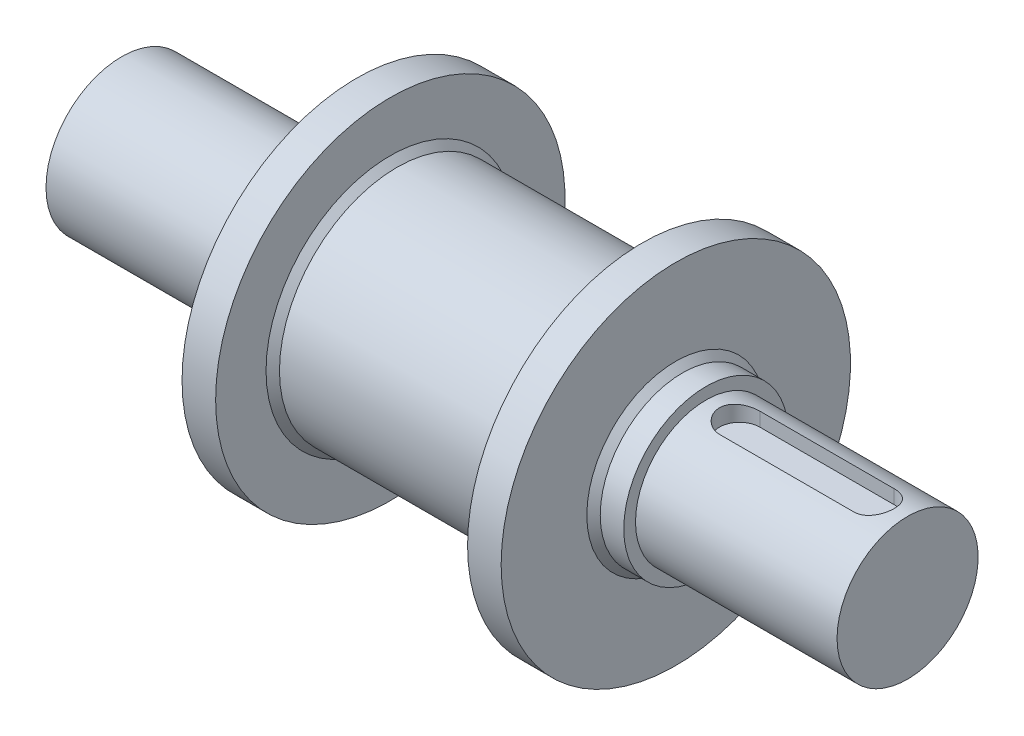
ISO-10303-21;
HEADER;
FILE_DESCRIPTION(('STEP AP214'),'2;1');
FILE_NAME('part.step','',(''),(''),'','','');
FILE_SCHEMA(('AUTOMOTIVE_DESIGN { 1 0 10303 214 1 1 1 1 }'));
ENDSEC;
DATA;
#1=APPLICATION_CONTEXT('core data for automotive mechanical design processes');
#2=APPLICATION_PROTOCOL_DEFINITION('international standard','automotive_design',2000,#1);
#3=PRODUCT_CONTEXT('',#1,'mechanical');
#4=PRODUCT('Part','Part','',(#3));
#5=PRODUCT_RELATED_PRODUCT_CATEGORY('part','',(#4));
#6=PRODUCT_DEFINITION_FORMATION('','',#4);
#7=PRODUCT_DEFINITION_CONTEXT('part definition',#1,'design');
#8=PRODUCT_DEFINITION('design','',#6,#7);
#9=PRODUCT_DEFINITION_SHAPE('','',#8);
#10=(LENGTH_UNIT() NAMED_UNIT(*) SI_UNIT(.MILLI.,.METRE.));
#11=(NAMED_UNIT(*) PLANE_ANGLE_UNIT() SI_UNIT($,.RADIAN.));
#12=(NAMED_UNIT(*) SI_UNIT($,.STERADIAN.) SOLID_ANGLE_UNIT());
#13=UNCERTAINTY_MEASURE_WITH_UNIT(LENGTH_MEASURE(1.E-05),#10,'distance_accuracy_value','');
#14=(GEOMETRIC_REPRESENTATION_CONTEXT(3) GLOBAL_UNCERTAINTY_ASSIGNED_CONTEXT((#13)) GLOBAL_UNIT_ASSIGNED_CONTEXT((#10,
#11,#12)) REPRESENTATION_CONTEXT('',''));
#15=CARTESIAN_POINT('',(0.,0.,0.));
#16=DIRECTION('',(0.,0.,1.));
#17=DIRECTION('',(1.,0.,0.));
#18=AXIS2_PLACEMENT_3D('',#15,#16,#17);
#19=CARTESIAN_POINT('',(0.,0.,0.));
#20=DIRECTION('',(-1.,0.,0.));
#21=DIRECTION('',(0.,0.,1.));
#22=AXIS2_PLACEMENT_3D('',#19,#20,#21);
#23=CYLINDRICAL_SURFACE('',#22,21.);
#24=CARTESIAN_POINT('',(174.,0.,0.));
#25=DIRECTION('',(-1.,0.,0.));
#26=DIRECTION('',(0.,0.,1.));
#27=AXIS2_PLACEMENT_3D('',#24,#25,#26);
#28=CIRCLE('',#27,21.);
#29=CARTESIAN_POINT('',(174.,0.,21.));
#30=VERTEX_POINT('',#29);
#31=EDGE_CURVE('E116',#30,#30,#28,.T.);
#32=ORIENTED_EDGE('',*,*,#31,.F.);
#33=EDGE_LOOP('',(#32));
#34=FACE_BOUND('',#33,.T.);
#35=CARTESIAN_POINT('',(234.,0.,0.));
#36=DIRECTION('',(-1.,0.,0.));
#37=DIRECTION('',(0.,0.,1.));
#38=AXIS2_PLACEMENT_3D('',#35,#36,#37);
#39=CIRCLE('',#38,21.);
#40=CARTESIAN_POINT('',(234.,0.,21.));
#41=VERTEX_POINT('',#40);
#42=EDGE_CURVE('E112',#41,#41,#39,.T.);
#43=ORIENTED_EDGE('',*,*,#42,.T.);
#44=EDGE_LOOP('',(#43));
#45=FACE_BOUND('',#44,.T.);
#46=CARTESIAN_POINT('',(224.,20.1246117974981,6.));
#47=CARTESIAN_POINT('',(224.165052331312,20.1245894844569,6.00002192169975));
#48=CARTESIAN_POINT('',(224.330096651925,20.1266415650335,5.9931904240759));
#49=CARTESIAN_POINT('',(224.658933521624,20.1347317436705,5.96598259693693));
#50=CARTESIAN_POINT('',(224.822726323157,20.1407690151806,5.94560907610498));
#51=CARTESIAN_POINT('',(225.147509956324,20.1566481622527,5.89154299099));
#52=CARTESIAN_POINT('',(225.308506490729,20.1664810208216,5.85788198887896));
#53=CARTESIAN_POINT('',(225.626960229472,20.1896457121068,5.77753958210296));
#54=CARTESIAN_POINT('',(225.78441735477,20.2029776228772,5.73085788698049));
#55=CARTESIAN_POINT('',(226.094635546118,20.2327374247249,5.62488729317033));
#56=CARTESIAN_POINT('',(226.247398940812,20.2491637507907,5.56560476546173));
#57=CARTESIAN_POINT('',(226.547368364294,20.2846467474582,5.43485915630498));
#58=CARTESIAN_POINT('',(226.694572302487,20.3037043952519,5.36339154736578));
#59=CARTESIAN_POINT('',(226.98243459612,20.3439081708857,5.20881695763319));
#60=CARTESIAN_POINT('',(227.123092954147,20.3650542979004,5.12570998143986));
#61=CARTESIAN_POINT('',(227.39705541808,20.4088630364894,4.94839867436058));
#62=CARTESIAN_POINT('',(227.530356713522,20.4315262203764,4.85419014508329));
#63=CARTESIAN_POINT('',(227.792038174735,20.4783436926205,4.65278362553809));
#64=CARTESIAN_POINT('',(227.92020679912,20.5025212494045,4.54531610125279));
#65=CARTESIAN_POINT('',(228.167146297308,20.5511665277305,4.32005021369056));
#66=CARTESIAN_POINT('',(228.285913661986,20.5756343537369,4.20224802715341));
#67=CARTESIAN_POINT('',(228.513215821272,20.6241797197623,3.95712206741071));
#68=CARTESIAN_POINT('',(228.621752630168,20.6482573358332,3.82980017742367));
#69=CARTESIAN_POINT('',(228.827939004997,20.6953839164428,3.56636964243007));
#70=CARTESIAN_POINT('',(228.925584545105,20.7184324987362,3.43025777747806));
#71=CARTESIAN_POINT('',(229.110945589449,20.7632735217347,3.14758929991082));
#72=CARTESIAN_POINT('',(229.198446889581,20.7850352899036,3.00088721837233));
#73=CARTESIAN_POINT('',(229.360771883345,20.826226420028,2.70024415256809));
#74=CARTESIAN_POINT('',(229.435591029334,20.8456549445903,2.54630059678401));
#75=CARTESIAN_POINT('',(229.571883383942,20.8816082415408,2.23235057760216));
#76=CARTESIAN_POINT('',(229.633361393562,20.898134058101,2.07234631966332));
#77=CARTESIAN_POINT('',(229.742475461033,20.9278108104084,1.74738349510969));
#78=CARTESIAN_POINT('',(229.790112095636,20.9409618867737,1.58242513524158));
#79=CARTESIAN_POINT('',(229.870065575121,20.9632114411614,1.25311298298007));
#80=CARTESIAN_POINT('',(229.902747347622,20.9724060858907,1.08885424992111));
#81=CARTESIAN_POINT('',(229.954270098755,20.9869654862023,0.758072191863195));
#82=CARTESIAN_POINT('',(229.973116248908,20.9923316727767,0.591549736734752));
#83=CARTESIAN_POINT('',(229.996814450333,20.9990869856429,0.257425560637054));
#84=CARTESIAN_POINT('',(230.001666015127,21.0004759736798,0.0898238023521121));
#85=CARTESIAN_POINT('',(229.997328274917,20.999236691677,-0.245181542828501));
#86=CARTESIAN_POINT('',(229.988139201944,20.9966084880238,-0.412585132953262));
#87=CARTESIAN_POINT('',(229.9562782772,20.9875445764644,-0.741067651658925));
#88=CARTESIAN_POINT('',(229.934007021276,20.9812220240654,-0.902188755140108));
#89=CARTESIAN_POINT('',(229.876494480959,20.9650286514685,-1.22197090652229));
#90=CARTESIAN_POINT('',(229.841249023442,20.9551566896347,-1.38063114576114));
#91=CARTESIAN_POINT('',(229.758089652863,20.9321284663263,-1.69432288207988));
#92=CARTESIAN_POINT('',(229.710177676022,20.918972706835,-1.84935492983109));
#93=CARTESIAN_POINT('',(229.602064962077,20.8897205698511,-2.15478873602949));
#94=CARTESIAN_POINT('',(229.541863855878,20.8736241040379,-2.30519035524902));
#95=CARTESIAN_POINT('',(229.408898376357,20.8387145142278,-2.60202980978099));
#96=CARTESIAN_POINT('',(229.336002252832,20.8198732783987,-2.74840530116376));
#97=CARTESIAN_POINT('',(229.178676237705,20.7801082571492,-3.0344604453685));
#98=CARTESIAN_POINT('',(229.09424991134,20.7591851160121,-3.17414215000025));
#99=CARTESIAN_POINT('',(228.914385979091,20.7157807359019,-3.44606990247428));
#100=CARTESIAN_POINT('',(228.818942919324,20.6932987274225,-3.57831221881556));
#101=CARTESIAN_POINT('',(228.617740718797,20.6473712971919,-3.83444718075924));
#102=CARTESIAN_POINT('',(228.511984957411,20.6239261924859,-3.95834253922788));
#103=CARTESIAN_POINT('',(228.28687436197,20.5758300072593,-4.20132091996746));
#104=CARTESIAN_POINT('',(228.16717064798,20.551165615785,-4.32007832115666));
#105=CARTESIAN_POINT('',(227.918208426458,20.5021333353903,-4.54708837545202));
#106=CARTESIAN_POINT('',(227.788953240124,20.4777653468064,-4.65534464996528));
#107=CARTESIAN_POINT('',(227.52158790413,20.4299846752419,-4.86074636422665));
#108=CARTESIAN_POINT('',(227.383471887605,20.4065726423519,-4.95788432140759));
#109=CARTESIAN_POINT('',(227.099406524312,20.3614014610979,-5.14024855061122));
#110=CARTESIAN_POINT('',(226.953460255218,20.3396416713267,-5.22547945590107));
#111=CARTESIAN_POINT('',(226.65330100046,20.2982196174412,-5.38414968403492));
#112=CARTESIAN_POINT('',(226.499025684695,20.2785778839985,-5.45747656574094));
#113=CARTESIAN_POINT('',(226.184550166332,20.242230137917,-5.59078652189583));
#114=CARTESIAN_POINT('',(226.024352400501,20.2255229337991,-5.65077501464742));
#115=CARTESIAN_POINT('',(225.699294796548,20.1955798271004,-5.75687380467081));
#116=CARTESIAN_POINT('',(225.534440027613,20.1823402998656,-5.80299860073585));
#117=CARTESIAN_POINT('',(225.201205342495,20.1597438752569,-5.88101802101864));
#118=CARTESIAN_POINT('',(225.032827097457,20.1503851792111,-5.91291923804017));
#119=CARTESIAN_POINT('',(224.720401863552,20.136996182678,-5.95834488604588));
#120=CARTESIAN_POINT('',(224.576682044629,20.1323602730056,-5.97396720737166));
#121=CARTESIAN_POINT('',(224.288645245918,20.1261641867038,-5.99479248698429));
#122=CARTESIAN_POINT('',(224.144329514862,20.1245993190641,-6.00001133674436));
#123=CARTESIAN_POINT('',(224.,20.1246117974981,-6.));
#124=B_SPLINE_CURVE_WITH_KNOTS('',3,(#46,#47,#48,#49,#50,#51,#52,#53,#54,#55,#56,#57,#58,#59,
#60,#61,#62,#63,#64,#65,#66,#67,#68,#69,#70,#71,#72,#73,#74,#75,#76,#77,#78,#79,#80,#81,#82,#83,
#84,#85,#86,#87,#88,#89,#90,#91,#92,#93,#94,#95,#96,#97,#98,#99,#100,#101,#102,#103,#104,#105,
#106,#107,#108,#109,#110,#111,#112,#113,#114,#115,#116,#117,#118,#119,#120,#121,#122,#123),
.UNSPECIFIED.,.F.,.F.,(4,2,2,2,2,2,2,2,2,2,2,2,2,2,2,2,2,2,2,2,2,2,2,2,2,2,2,2,2,2,2,2,2,2,2,2,
2,2,4),(0.,0.494990614565442,0.98987859762957,1.48359806377502,1.97732854438847,2.4708099862205,
2.96447518729517,3.45814019326608,3.95199249653474,4.45841161341089,4.96501887414657,
5.47152618001261,5.97822009394079,6.49417839820206,7.01032132824592,7.52627820764116,
8.04221358474347,8.54478221320034,9.04716289419293,9.54956103869483,10.0519508808723,
10.5397044924402,11.027615126156,11.5154512202231,12.0033019682409,12.4965554906444,
12.9896568387743,13.4830033544228,13.9761887449054,14.4868330315598,14.997300587207,
15.5081096895234,16.0187194690592,16.5339022452487,17.0488753606756,17.5633080229981,
18.077501990939,18.5110248049339,18.9438848967365),.UNSPECIFIED.);
#125=CARTESIAN_POINT('',(224.,20.1246117974981,6.));
#126=VERTEX_POINT('',#125);
#127=CARTESIAN_POINT('',(224.,20.1246117974981,-6.));
#128=VERTEX_POINT('',#127);
#129=EDGE_CURVE('E11',#126,#128,#124,.T.);
#130=ORIENTED_EDGE('',*,*,#129,.F.);
#131=DIRECTION('',(-1.,0.,0.));
#132=VECTOR('',#131,1.);
#133=CARTESIAN_POINT('',(0.,20.1246117974981,6.00000000000002));
#134=LINE('',#133,#132);
#135=CARTESIAN_POINT('',(184.,20.1246117974981,6.));
#136=VERTEX_POINT('',#135);
#137=EDGE_CURVE('E51',#126,#136,#134,.T.);
#138=ORIENTED_EDGE('',*,*,#137,.T.);
#139=CARTESIAN_POINT('',(184.,20.1246117974981,6.));
#140=CARTESIAN_POINT('',(183.834947668688,20.1245894844569,6.00002192169975));
#141=CARTESIAN_POINT('',(183.669903348075,20.1266415650335,5.9931904240759));
#142=CARTESIAN_POINT('',(183.341066478376,20.1347317436705,5.96598259693693));
#143=CARTESIAN_POINT('',(183.177273676843,20.1407690151806,5.94560907610498));
#144=CARTESIAN_POINT('',(182.852490043676,20.1566481622527,5.89154299099));
#145=CARTESIAN_POINT('',(182.691493509271,20.1664810208216,5.85788198887896));
#146=CARTESIAN_POINT('',(182.373039770528,20.1896457121068,5.77753958210296));
#147=CARTESIAN_POINT('',(182.21558264523,20.2029776228772,5.73085788698049));
#148=CARTESIAN_POINT('',(181.905364453882,20.2327374247249,5.62488729317033));
#149=CARTESIAN_POINT('',(181.752601059188,20.2491637507907,5.56560476546173));
#150=CARTESIAN_POINT('',(181.452631635706,20.2846467474582,5.43485915630498));
#151=CARTESIAN_POINT('',(181.305427697513,20.3037043952519,5.36339154736578));
#152=CARTESIAN_POINT('',(181.01756540388,20.3439081708857,5.20881695763319));
#153=CARTESIAN_POINT('',(180.876907045853,20.3650542979004,5.12570998143987));
#154=CARTESIAN_POINT('',(180.60294458192,20.4088630364894,4.94839867436059));
#155=CARTESIAN_POINT('',(180.469643286478,20.4315262203764,4.85419014508329));
#156=CARTESIAN_POINT('',(180.207961825265,20.4783436926205,4.65278362553809));
#157=CARTESIAN_POINT('',(180.07979320088,20.5025212494045,4.54531610125279));
#158=CARTESIAN_POINT('',(179.832853702692,20.5511665277305,4.32005021369056));
#159=CARTESIAN_POINT('',(179.714086338014,20.5756343537369,4.20224802715341));
#160=CARTESIAN_POINT('',(179.486784178728,20.6241797197623,3.95712206741071));
#161=CARTESIAN_POINT('',(179.378247369831,20.6482573358332,3.82980017742366));
#162=CARTESIAN_POINT('',(179.172060995003,20.6953839164428,3.56636964243007));
#163=CARTESIAN_POINT('',(179.074415454895,20.7184324987362,3.43025777747806));
#164=CARTESIAN_POINT('',(178.889054410551,20.7632735217347,3.14758929991082));
#165=CARTESIAN_POINT('',(178.801553110419,20.7850352899036,3.00088721837233));
#166=CARTESIAN_POINT('',(178.639228116655,20.826226420028,2.70024415256809));
#167=CARTESIAN_POINT('',(178.564408970666,20.8456549445903,2.54630059678401));
#168=CARTESIAN_POINT('',(178.428116616058,20.8816082415408,2.23235057760216));
#169=CARTESIAN_POINT('',(178.366638606438,20.898134058101,2.07234631966332));
#170=CARTESIAN_POINT('',(178.257524538966,20.9278108104084,1.74738349510969));
#171=CARTESIAN_POINT('',(178.209887904364,20.9409618867737,1.58242513524158));
#172=CARTESIAN_POINT('',(178.129934424879,20.9632114411614,1.25311298298007));
#173=CARTESIAN_POINT('',(178.097252652378,20.9724060858907,1.08885424992111));
#174=CARTESIAN_POINT('',(178.045729901245,20.9869654862023,0.758072191863195));
#175=CARTESIAN_POINT('',(178.026883751092,20.9923316727767,0.591549736734752));
#176=CARTESIAN_POINT('',(178.003185549667,20.9990869856429,0.257425560637054));
#177=CARTESIAN_POINT('',(177.998333984873,21.0004759736798,0.0898238023521121));
#178=CARTESIAN_POINT('',(178.002671725083,20.999236691677,-0.245181542828501));
#179=CARTESIAN_POINT('',(178.011860798056,20.9966084880238,-0.412585132953262));
#180=CARTESIAN_POINT('',(178.0437217228,20.9875445764644,-0.741067651658926));
#181=CARTESIAN_POINT('',(178.065992978724,20.9812220240654,-0.90218875514011));
#182=CARTESIAN_POINT('',(178.123505519041,20.9650286514685,-1.2219709065223));
#183=CARTESIAN_POINT('',(178.158750976558,20.9551566896347,-1.38063114576115));
#184=CARTESIAN_POINT('',(178.241910347137,20.9321284663263,-1.69432288207988));
#185=CARTESIAN_POINT('',(178.289822323978,20.918972706835,-1.84935492983109));
#186=CARTESIAN_POINT('',(178.397935037923,20.8897205698511,-2.15478873602949));
#187=CARTESIAN_POINT('',(178.458136144122,20.8736241040379,-2.30519035524902));
#188=CARTESIAN_POINT('',(178.591101623643,20.8387145142278,-2.60202980978099));
#189=CARTESIAN_POINT('',(178.663997747168,20.8198732783987,-2.74840530116376));
#190=CARTESIAN_POINT('',(178.821323762295,20.7801082571492,-3.0344604453685));
#191=CARTESIAN_POINT('',(178.90575008866,20.7591851160121,-3.17414215000025));
#192=CARTESIAN_POINT('',(179.085614020909,20.7157807359019,-3.44606990247428));
#193=CARTESIAN_POINT('',(179.181057080676,20.6932987274225,-3.57831221881556));
#194=CARTESIAN_POINT('',(179.382259281203,20.6473712971919,-3.83444718075924));
#195=CARTESIAN_POINT('',(179.488015042589,20.6239261924859,-3.95834253922788));
#196=CARTESIAN_POINT('',(179.71312563803,20.5758300072593,-4.20132091996746));
#197=CARTESIAN_POINT('',(179.83282935202,20.551165615785,-4.32007832115666));
#198=CARTESIAN_POINT('',(180.081791573542,20.5021333353903,-4.54708837545202));
#199=CARTESIAN_POINT('',(180.211046759876,20.4777653468064,-4.65534464996528));
#200=CARTESIAN_POINT('',(180.47841209587,20.4299846752419,-4.86074636422665));
#201=CARTESIAN_POINT('',(180.616528112395,20.4065726423519,-4.9578843214076));
#202=CARTESIAN_POINT('',(180.900593475688,20.3614014610979,-5.14024855061123));
#203=CARTESIAN_POINT('',(181.046539744782,20.3396416713267,-5.22547945590107));
#204=CARTESIAN_POINT('',(181.34669899954,20.2982196174412,-5.38414968403492));
#205=CARTESIAN_POINT('',(181.500974315305,20.2785778839985,-5.45747656574094));
#206=CARTESIAN_POINT('',(181.815449833668,20.242230137917,-5.59078652189583));
#207=CARTESIAN_POINT('',(181.975647599499,20.2255229337991,-5.65077501464742));
#208=CARTESIAN_POINT('',(182.300705203452,20.1955798271004,-5.75687380467081));
#209=CARTESIAN_POINT('',(182.465559972387,20.1823402998656,-5.80299860073585));
#210=CARTESIAN_POINT('',(182.798794657505,20.1597438752569,-5.88101802101864));
#211=CARTESIAN_POINT('',(182.967172902543,20.1503851792111,-5.91291923804017));
#212=CARTESIAN_POINT('',(183.279598136448,20.136996182678,-5.95834488604588));
#213=CARTESIAN_POINT('',(183.423317955371,20.1323602730056,-5.97396720737166));
#214=CARTESIAN_POINT('',(183.711354754082,20.1261641867038,-5.99479248698429));
#215=CARTESIAN_POINT('',(183.855670485138,20.1245993190641,-6.00001133674436));
#216=CARTESIAN_POINT('',(184.,20.1246117974981,-6.));
#217=B_SPLINE_CURVE_WITH_KNOTS('',3,(#139,#140,#141,#142,#143,#144,#145,#146,#147,#148,#149,
#150,#151,#152,#153,#154,#155,#156,#157,#158,#159,#160,#161,#162,#163,#164,#165,#166,#167,#168,
#169,#170,#171,#172,#173,#174,#175,#176,#177,#178,#179,#180,#181,#182,#183,#184,#185,#186,#187,
#188,#189,#190,#191,#192,#193,#194,#195,#196,#197,#198,#199,#200,#201,#202,#203,#204,#205,#206,
#207,#208,#209,#210,#211,#212,#213,#214,#215,#216),.UNSPECIFIED.,.F.,.F.,(4,2,2,2,2,2,2,2,2,2,2,
2,2,2,2,2,2,2,2,2,2,2,2,2,2,2,2,2,2,2,2,2,2,2,2,2,2,2,4),(0.,0.494990614565442,0.98987859762957,
1.48359806377502,1.97732854438847,2.4708099862205,2.96447518729517,3.45814019326605,
3.95199249653474,4.45841161341089,4.96501887414657,5.47152618001263,5.97822009394079,
6.49417839820206,7.01032132824592,7.52627820764117,8.04221358474347,8.54478221320035,
9.04716289419293,9.54956103869483,10.0519508808723,10.5397044924402,11.027615126156,
11.5154512202231,12.0033019682409,12.4965554906444,12.9896568387743,13.4830033544228,
13.9761887449054,14.4868330315598,14.997300587207,15.5081096895234,16.0187194690592,
16.5339022452487,17.0488753606756,17.5633080229981,18.077501990939,18.5110248049339,
18.9438848967365),.UNSPECIFIED.);
#218=CARTESIAN_POINT('',(184.,20.1246117974981,-6.));
#219=VERTEX_POINT('',#218);
#220=EDGE_CURVE('E63',#136,#219,#217,.T.);
#221=ORIENTED_EDGE('',*,*,#220,.T.);
#222=DIRECTION('',(-1.,0.,0.));
#223=VECTOR('',#222,1.);
#224=CARTESIAN_POINT('',(0.,20.1246117974981,-5.99999999999998));
#225=LINE('',#224,#223);
#226=EDGE_CURVE('E170',#219,#128,#225,.F.);
#227=ORIENTED_EDGE('',*,*,#226,.T.);
#228=EDGE_LOOP('',(#130,#138,#221,#227));
#229=FACE_BOUND('',#228,.T.);
#230=ADVANCED_FACE('F36',(#34,#45,#229),#23,.T.);
#231=CARTESIAN_POINT('',(0.,0.,0.));
#232=DIRECTION('',(1.,0.,0.));
#233=DIRECTION('',(0.,0.,-1.));
#234=AXIS2_PLACEMENT_3D('',#231,#232,#233);
#235=PLANE('',#234);
#236=CARTESIAN_POINT('',(0.,0.,0.));
#237=DIRECTION('',(-1.,0.,0.));
#238=DIRECTION('',(0.,0.,1.));
#239=AXIS2_PLACEMENT_3D('',#236,#237,#238);
#240=CIRCLE('',#239,22.5);
#241=CARTESIAN_POINT('',(0.,0.,22.5));
#242=VERTEX_POINT('',#241);
#243=EDGE_CURVE('E143',#242,#242,#240,.T.);
#244=ORIENTED_EDGE('',*,*,#243,.T.);
#245=EDGE_LOOP('',(#244));
#246=FACE_BOUND('',#245,.T.);
#247=ADVANCED_FACE('F199',(#246),#235,.F.);
#248=CARTESIAN_POINT('',(0.,0.,0.));
#249=DIRECTION('',(-1.,0.,0.));
#250=DIRECTION('',(0.,0.,1.));
#251=AXIS2_PLACEMENT_3D('',#248,#249,#250);
#252=CYLINDRICAL_SURFACE('',#251,22.5);
#253=ORIENTED_EDGE('',*,*,#243,.F.);
#254=EDGE_LOOP('',(#253));
#255=FACE_BOUND('',#254,.T.);
#256=CARTESIAN_POINT('',(65.,0.,0.));
#257=DIRECTION('',(-1.,0.,0.));
#258=DIRECTION('',(0.,0.,1.));
#259=AXIS2_PLACEMENT_3D('',#256,#257,#258);
#260=CIRCLE('',#259,22.5);
#261=CARTESIAN_POINT('',(65.,0.,22.5));
#262=VERTEX_POINT('',#261);
#263=EDGE_CURVE('E140',#262,#262,#260,.T.);
#264=ORIENTED_EDGE('',*,*,#263,.T.);
#265=EDGE_LOOP('',(#264));
#266=FACE_BOUND('',#265,.T.);
#267=ADVANCED_FACE('F204',(#255,#266),#252,.T.);
#268=CARTESIAN_POINT('',(65.,22.5,0.));
#269=DIRECTION('',(1.,0.,0.));
#270=DIRECTION('',(0.,0.,-1.));
#271=AXIS2_PLACEMENT_3D('',#268,#269,#270);
#272=PLANE('',#271);
#273=ORIENTED_EDGE('',*,*,#263,.F.);
#274=EDGE_LOOP('',(#273));
#275=FACE_BOUND('',#274,.T.);
#276=CARTESIAN_POINT('',(65.,0.,0.));
#277=DIRECTION('',(-1.,0.,0.));
#278=DIRECTION('',(0.,0.,1.));
#279=AXIS2_PLACEMENT_3D('',#276,#277,#278);
#280=CIRCLE('',#279,27.);
#281=CARTESIAN_POINT('',(65.,0.,27.));
#282=VERTEX_POINT('',#281);
#283=EDGE_CURVE('E137',#282,#282,#280,.T.);
#284=ORIENTED_EDGE('',*,*,#283,.T.);
#285=EDGE_LOOP('',(#284));
#286=FACE_BOUND('',#285,.T.);
#287=ADVANCED_FACE('F214',(#275,#286),#272,.F.);
#288=CARTESIAN_POINT('',(0.,0.,0.));
#289=DIRECTION('',(-1.,0.,0.));
#290=DIRECTION('',(0.,0.,1.));
#291=AXIS2_PLACEMENT_3D('',#288,#289,#290);
#292=CYLINDRICAL_SURFACE('',#291,27.);
#293=ORIENTED_EDGE('',*,*,#283,.F.);
#294=EDGE_LOOP('',(#293));
#295=FACE_BOUND('',#294,.T.);
#296=CARTESIAN_POINT('',(70.,0.,0.));
#297=DIRECTION('',(-1.,0.,0.));
#298=DIRECTION('',(0.,0.,1.));
#299=AXIS2_PLACEMENT_3D('',#296,#297,#298);
#300=CIRCLE('',#299,27.);
#301=CARTESIAN_POINT('',(70.,0.,27.));
#302=VERTEX_POINT('',#301);
#303=EDGE_CURVE('E134',#302,#302,#300,.T.);
#304=ORIENTED_EDGE('',*,*,#303,.T.);
#305=EDGE_LOOP('',(#304));
#306=FACE_BOUND('',#305,.T.);
#307=ADVANCED_FACE('F257',(#295,#306),#292,.T.);
#308=CARTESIAN_POINT('',(70.,27.,0.));
#309=DIRECTION('',(1.,0.,0.));
#310=DIRECTION('',(0.,0.,-1.));
#311=AXIS2_PLACEMENT_3D('',#308,#309,#310);
#312=PLANE('',#311);
#313=ORIENTED_EDGE('',*,*,#303,.F.);
#314=EDGE_LOOP('',(#313));
#315=FACE_BOUND('',#314,.T.);
#316=CARTESIAN_POINT('',(70.,0.,0.));
#317=DIRECTION('',(-1.,0.,0.));
#318=DIRECTION('',(0.,0.,1.));
#319=AXIS2_PLACEMENT_3D('',#316,#317,#318);
#320=CIRCLE('',#319,52.);
#321=CARTESIAN_POINT('',(70.,0.,52.));
#322=VERTEX_POINT('',#321);
#323=EDGE_CURVE('E131',#322,#322,#320,.T.);
#324=ORIENTED_EDGE('',*,*,#323,.T.);
#325=EDGE_LOOP('',(#324));
#326=FACE_BOUND('',#325,.T.);
#327=ADVANCED_FACE('F251',(#315,#326),#312,.F.);
#328=CARTESIAN_POINT('',(0.,0.,0.));
#329=DIRECTION('',(-1.,0.,0.));
#330=DIRECTION('',(0.,0.,1.));
#331=AXIS2_PLACEMENT_3D('',#328,#329,#330);
#332=CYLINDRICAL_SURFACE('',#331,52.);
#333=ORIENTED_EDGE('',*,*,#323,.F.);
#334=EDGE_LOOP('',(#333));
#335=FACE_BOUND('',#334,.T.);
#336=CARTESIAN_POINT('',(80.,0.,0.));
#337=DIRECTION('',(-1.,0.,0.));
#338=DIRECTION('',(0.,0.,1.));
#339=AXIS2_PLACEMENT_3D('',#336,#337,#338);
#340=CIRCLE('',#339,52.);
#341=CARTESIAN_POINT('',(80.,0.,52.));
#342=VERTEX_POINT('',#341);
#343=EDGE_CURVE('E128',#342,#342,#340,.T.);
#344=ORIENTED_EDGE('',*,*,#343,.T.);
#345=EDGE_LOOP('',(#344));
#346=FACE_BOUND('',#345,.T.);
#347=ADVANCED_FACE('F246',(#335,#346),#332,.T.);
#348=CARTESIAN_POINT('',(80.,52.,0.));
#349=DIRECTION('',(-1.,0.,0.));
#350=DIRECTION('',(0.,0.,1.));
#351=AXIS2_PLACEMENT_3D('',#348,#349,#350);
#352=PLANE('',#351);
#353=CARTESIAN_POINT('',(80.,0.,0.));
#354=DIRECTION('',(-1.,0.,0.));
#355=DIRECTION('',(0.,0.,1.));
#356=AXIS2_PLACEMENT_3D('',#353,#354,#355);
#357=CIRCLE('',#356,37.);
#358=CARTESIAN_POINT('',(80.,0.,37.));
#359=VERTEX_POINT('',#358);
#360=EDGE_CURVE('E161',#359,#359,#357,.T.);
#361=ORIENTED_EDGE('',*,*,#360,.T.);
#362=EDGE_LOOP('',(#361));
#363=FACE_BOUND('',#362,.T.);
#364=ORIENTED_EDGE('',*,*,#343,.F.);
#365=EDGE_LOOP('',(#364));
#366=FACE_BOUND('',#365,.T.);
#367=ADVANCED_FACE('F238',(#363,#366),#352,.F.);
#368=CARTESIAN_POINT('',(0.,0.,0.));
#369=DIRECTION('',(-1.,0.,0.));
#370=DIRECTION('',(0.,0.,1.));
#371=AXIS2_PLACEMENT_3D('',#368,#369,#370);
#372=CYLINDRICAL_SURFACE('',#371,35.);
#373=CARTESIAN_POINT('',(153.,0.,0.));
#374=DIRECTION('',(1.,0.,0.));
#375=DIRECTION('',(0.,0.,-1.));
#376=AXIS2_PLACEMENT_3D('',#373,#374,#375);
#377=CIRCLE('',#376,35.);
#378=CARTESIAN_POINT('',(153.,0.,-35.));
#379=VERTEX_POINT('',#378);
#380=EDGE_CURVE('E155',#379,#379,#377,.F.);
#381=ORIENTED_EDGE('',*,*,#380,.T.);
#382=EDGE_LOOP('',(#381));
#383=FACE_BOUND('',#382,.T.);
#384=CARTESIAN_POINT('',(82.,0.,0.));
#385=DIRECTION('',(-1.,0.,0.));
#386=DIRECTION('',(0.,0.,1.));
#387=AXIS2_PLACEMENT_3D('',#384,#385,#386);
#388=CIRCLE('',#387,35.);
#389=CARTESIAN_POINT('',(82.,0.,35.));
#390=VERTEX_POINT('',#389);
#391=EDGE_CURVE('E152',#390,#390,#388,.F.);
#392=ORIENTED_EDGE('',*,*,#391,.T.);
#393=EDGE_LOOP('',(#392));
#394=FACE_BOUND('',#393,.T.);
#395=ADVANCED_FACE('F234',(#383,#394),#372,.T.);
#396=CARTESIAN_POINT('',(155.,35.,0.));
#397=DIRECTION('',(1.,0.,0.));
#398=DIRECTION('',(0.,0.,-1.));
#399=AXIS2_PLACEMENT_3D('',#396,#397,#398);
#400=PLANE('',#399);
#401=CARTESIAN_POINT('',(155.,0.,0.));
#402=DIRECTION('',(1.,0.,0.));
#403=DIRECTION('',(0.,0.,-1.));
#404=AXIS2_PLACEMENT_3D('',#401,#402,#403);
#405=CIRCLE('',#404,37.);
#406=CARTESIAN_POINT('',(155.,0.,-37.));
#407=VERTEX_POINT('',#406);
#408=EDGE_CURVE('E158',#407,#407,#405,.T.);
#409=ORIENTED_EDGE('',*,*,#408,.T.);
#410=EDGE_LOOP('',(#409));
#411=FACE_BOUND('',#410,.T.);
#412=CARTESIAN_POINT('',(155.,0.,0.));
#413=DIRECTION('',(-1.,0.,0.));
#414=DIRECTION('',(0.,0.,1.));
#415=AXIS2_PLACEMENT_3D('',#412,#413,#414);
#416=CIRCLE('',#415,52.);
#417=CARTESIAN_POINT('',(155.,0.,52.));
#418=VERTEX_POINT('',#417);
#419=EDGE_CURVE('E125',#418,#418,#416,.T.);
#420=ORIENTED_EDGE('',*,*,#419,.T.);
#421=EDGE_LOOP('',(#420));
#422=FACE_BOUND('',#421,.T.);
#423=ADVANCED_FACE('F237',(#411,#422),#400,.F.);
#424=CARTESIAN_POINT('',(0.,0.,0.));
#425=DIRECTION('',(-1.,0.,0.));
#426=DIRECTION('',(0.,0.,1.));
#427=AXIS2_PLACEMENT_3D('',#424,#425,#426);
#428=CYLINDRICAL_SURFACE('',#427,52.);
#429=ORIENTED_EDGE('',*,*,#419,.F.);
#430=EDGE_LOOP('',(#429));
#431=FACE_BOUND('',#430,.T.);
#432=CARTESIAN_POINT('',(165.,0.,0.));
#433=DIRECTION('',(-1.,0.,0.));
#434=DIRECTION('',(0.,0.,1.));
#435=AXIS2_PLACEMENT_3D('',#432,#433,#434);
#436=CIRCLE('',#435,52.);
#437=CARTESIAN_POINT('',(165.,0.,52.));
#438=VERTEX_POINT('',#437);
#439=EDGE_CURVE('E122',#438,#438,#436,.T.);
#440=ORIENTED_EDGE('',*,*,#439,.T.);
#441=EDGE_LOOP('',(#440));
#442=FACE_BOUND('',#441,.T.);
#443=ADVANCED_FACE('F295',(#431,#442),#428,.T.);
#444=CARTESIAN_POINT('',(165.,52.,0.));
#445=DIRECTION('',(-1.,0.,0.));
#446=DIRECTION('',(0.,0.,1.));
#447=AXIS2_PLACEMENT_3D('',#444,#445,#446);
#448=PLANE('',#447);
#449=CARTESIAN_POINT('',(165.,0.,0.));
#450=DIRECTION('',(-1.,0.,0.));
#451=DIRECTION('',(0.,0.,1.));
#452=AXIS2_PLACEMENT_3D('',#449,#450,#451);
#453=CIRCLE('',#452,26.5);
#454=CARTESIAN_POINT('',(165.,0.,26.5));
#455=VERTEX_POINT('',#454);
#456=EDGE_CURVE('E146',#455,#455,#453,.T.);
#457=ORIENTED_EDGE('',*,*,#456,.T.);
#458=EDGE_LOOP('',(#457));
#459=FACE_BOUND('',#458,.T.);
#460=ORIENTED_EDGE('',*,*,#439,.F.);
#461=EDGE_LOOP('',(#460));
#462=FACE_BOUND('',#461,.T.);
#463=ADVANCED_FACE('F300',(#459,#462),#448,.F.);
#464=CARTESIAN_POINT('',(0.,0.,0.));
#465=DIRECTION('',(-1.,0.,0.));
#466=DIRECTION('',(0.,0.,1.));
#467=AXIS2_PLACEMENT_3D('',#464,#465,#466);
#468=CYLINDRICAL_SURFACE('',#467,24.5);
#469=CARTESIAN_POINT('',(167.,0.,0.));
#470=DIRECTION('',(-1.,0.,0.));
#471=DIRECTION('',(0.,0.,1.));
#472=AXIS2_PLACEMENT_3D('',#469,#470,#471);
#473=CIRCLE('',#472,24.5);
#474=CARTESIAN_POINT('',(167.,0.,24.5));
#475=VERTEX_POINT('',#474);
#476=EDGE_CURVE('E149',#475,#475,#473,.F.);
#477=ORIENTED_EDGE('',*,*,#476,.T.);
#478=EDGE_LOOP('',(#477));
#479=FACE_BOUND('',#478,.T.);
#480=CARTESIAN_POINT('',(174.,0.,0.));
#481=DIRECTION('',(-1.,0.,0.));
#482=DIRECTION('',(0.,0.,1.));
#483=AXIS2_PLACEMENT_3D('',#480,#481,#482);
#484=CIRCLE('',#483,24.5);
#485=CARTESIAN_POINT('',(174.,0.,24.5));
#486=VERTEX_POINT('',#485);
#487=EDGE_CURVE('E119',#486,#486,#484,.T.);
#488=ORIENTED_EDGE('',*,*,#487,.T.);
#489=EDGE_LOOP('',(#488));
#490=FACE_BOUND('',#489,.T.);
#491=ADVANCED_FACE('F195',(#479,#490),#468,.T.);
#492=CARTESIAN_POINT('',(174.,24.5,0.));
#493=DIRECTION('',(-1.,0.,0.));
#494=DIRECTION('',(0.,0.,1.));
#495=AXIS2_PLACEMENT_3D('',#492,#493,#494);
#496=PLANE('',#495);
#497=ORIENTED_EDGE('',*,*,#487,.F.);
#498=EDGE_LOOP('',(#497));
#499=FACE_BOUND('',#498,.T.);
#500=ORIENTED_EDGE('',*,*,#31,.T.);
#501=EDGE_LOOP('',(#500));
#502=FACE_BOUND('',#501,.T.);
#503=ADVANCED_FACE('F186',(#499,#502),#496,.F.);
#504=CARTESIAN_POINT('',(234.,21.,0.));
#505=DIRECTION('',(-1.,0.,0.));
#506=DIRECTION('',(0.,0.,1.));
#507=AXIS2_PLACEMENT_3D('',#504,#505,#506);
#508=PLANE('',#507);
#509=ORIENTED_EDGE('',*,*,#42,.F.);
#510=EDGE_LOOP('',(#509));
#511=FACE_BOUND('',#510,.T.);
#512=ADVANCED_FACE('F183',(#511),#508,.F.);
#513=CARTESIAN_POINT('',(165.,0.,0.));
#514=DIRECTION('',(-1.,0.,0.));
#515=DIRECTION('',(0.,0.,1.));
#516=AXIS2_PLACEMENT_3D('',#513,#514,#515);
#517=CONICAL_SURFACE('',#516,26.5,0.785398163397447);
#518=ORIENTED_EDGE('',*,*,#476,.F.);
#519=EDGE_LOOP('',(#518));
#520=FACE_BOUND('',#519,.T.);
#521=ORIENTED_EDGE('',*,*,#456,.F.);
#522=EDGE_LOOP('',(#521));
#523=FACE_BOUND('',#522,.T.);
#524=ADVANCED_FACE('F185',(#520,#523),#517,.T.);
#525=CARTESIAN_POINT('',(153.,0.,0.));
#526=DIRECTION('',(1.,0.,0.));
#527=DIRECTION('',(0.,0.,-1.));
#528=AXIS2_PLACEMENT_3D('',#525,#526,#527);
#529=CONICAL_SURFACE('',#528,35.,0.785398163397448);
#530=ORIENTED_EDGE('',*,*,#408,.F.);
#531=EDGE_LOOP('',(#530));
#532=FACE_BOUND('',#531,.T.);
#533=ORIENTED_EDGE('',*,*,#380,.F.);
#534=EDGE_LOOP('',(#533));
#535=FACE_BOUND('',#534,.T.);
#536=ADVANCED_FACE('F192',(#532,#535),#529,.T.);
#537=CARTESIAN_POINT('',(80.,0.,0.));
#538=DIRECTION('',(-1.,0.,0.));
#539=DIRECTION('',(0.,0.,1.));
#540=AXIS2_PLACEMENT_3D('',#537,#538,#539);
#541=CONICAL_SURFACE('',#540,37.,0.785398163397448);
#542=ORIENTED_EDGE('',*,*,#391,.F.);
#543=EDGE_LOOP('',(#542));
#544=FACE_BOUND('',#543,.T.);
#545=ORIENTED_EDGE('',*,*,#360,.F.);
#546=EDGE_LOOP('',(#545));
#547=FACE_BOUND('',#546,.T.);
#548=ADVANCED_FACE('F39',(#544,#547),#541,.T.);
#549=CARTESIAN_POINT('',(204.,16.,-6.));
#550=DIRECTION('',(0.,0.,-1.));
#551=DIRECTION('',(-1.,0.,0.));
#552=AXIS2_PLACEMENT_3D('',#549,#550,#551);
#553=PLANE('',#552);
#554=DIRECTION('',(0.,1.,0.));
#555=VECTOR('',#554,1.);
#556=CARTESIAN_POINT('',(184.,16.,-6.));
#557=LINE('',#556,#555);
#558=CARTESIAN_POINT('',(184.,16.,-6.));
#559=VERTEX_POINT('',#558);
#560=EDGE_CURVE('E58',#559,#219,#557,.T.);
#561=ORIENTED_EDGE('',*,*,#560,.F.);
#562=DIRECTION('',(-1.,0.,0.));
#563=VECTOR('',#562,1.);
#564=CARTESIAN_POINT('',(204.,16.,-6.));
#565=LINE('',#564,#563);
#566=CARTESIAN_POINT('',(224.,16.,-6.));
#567=VERTEX_POINT('',#566);
#568=EDGE_CURVE('E105',#567,#559,#565,.T.);
#569=ORIENTED_EDGE('',*,*,#568,.F.);
#570=DIRECTION('',(0.,1.,0.));
#571=VECTOR('',#570,1.);
#572=CARTESIAN_POINT('',(224.,16.,-6.));
#573=LINE('',#572,#571);
#574=EDGE_CURVE('E99',#567,#128,#573,.T.);
#575=ORIENTED_EDGE('',*,*,#574,.T.);
#576=ORIENTED_EDGE('',*,*,#226,.F.);
#577=EDGE_LOOP('',(#561,#569,#575,#576));
#578=FACE_BOUND('',#577,.T.);
#579=ADVANCED_FACE('F180',(#578),#553,.F.);
#580=CARTESIAN_POINT('',(204.,16.,6.));
#581=DIRECTION('',(0.,0.,1.));
#582=DIRECTION('',(1.,0.,0.));
#583=AXIS2_PLACEMENT_3D('',#580,#581,#582);
#584=PLANE('',#583);
#585=ORIENTED_EDGE('',*,*,#137,.F.);
#586=DIRECTION('',(0.,1.,0.));
#587=VECTOR('',#586,1.);
#588=CARTESIAN_POINT('',(224.,16.,6.));
#589=LINE('',#588,#587);
#590=CARTESIAN_POINT('',(224.,16.,6.));
#591=VERTEX_POINT('',#590);
#592=EDGE_CURVE('E97',#591,#126,#589,.T.);
#593=ORIENTED_EDGE('',*,*,#592,.F.);
#594=DIRECTION('',(1.,0.,0.));
#595=VECTOR('',#594,1.);
#596=CARTESIAN_POINT('',(204.,16.,6.));
#597=LINE('',#596,#595);
#598=CARTESIAN_POINT('',(184.,16.,6.));
#599=VERTEX_POINT('',#598);
#600=EDGE_CURVE('E84',#599,#591,#597,.T.);
#601=ORIENTED_EDGE('',*,*,#600,.F.);
#602=DIRECTION('',(0.,1.,0.));
#603=VECTOR('',#602,1.);
#604=CARTESIAN_POINT('',(184.,16.,6.));
#605=LINE('',#604,#603);
#606=EDGE_CURVE('E110',#599,#136,#605,.T.);
#607=ORIENTED_EDGE('',*,*,#606,.T.);
#608=EDGE_LOOP('',(#585,#593,#601,#607));
#609=FACE_BOUND('',#608,.T.);
#610=ADVANCED_FACE('F102',(#609),#584,.F.);
#611=CARTESIAN_POINT('',(184.,16.,0.));
#612=DIRECTION('',(0.,1.,0.));
#613=DIRECTION('',(0.,0.,1.));
#614=AXIS2_PLACEMENT_3D('',#611,#612,#613);
#615=CYLINDRICAL_SURFACE('',#614,6.);
#616=ORIENTED_EDGE('',*,*,#606,.F.);
#617=CARTESIAN_POINT('',(184.,16.,0.));
#618=DIRECTION('',(0.,1.,0.));
#619=DIRECTION('',(0.,0.,1.));
#620=AXIS2_PLACEMENT_3D('',#617,#618,#619);
#621=CIRCLE('',#620,6.);
#622=EDGE_CURVE('E90',#559,#599,#621,.T.);
#623=ORIENTED_EDGE('',*,*,#622,.F.);
#624=ORIENTED_EDGE('',*,*,#560,.T.);
#625=ORIENTED_EDGE('',*,*,#220,.F.);
#626=EDGE_LOOP('',(#616,#623,#624,#625));
#627=FACE_BOUND('',#626,.T.);
#628=ADVANCED_FACE('F174',(#627),#615,.F.);
#629=CARTESIAN_POINT('',(184.,16.,0.));
#630=DIRECTION('',(0.,1.,0.));
#631=DIRECTION('',(0.,0.,1.));
#632=AXIS2_PLACEMENT_3D('',#629,#630,#631);
#633=PLANE('',#632);
#634=ORIENTED_EDGE('',*,*,#568,.T.);
#635=ORIENTED_EDGE('',*,*,#622,.T.);
#636=ORIENTED_EDGE('',*,*,#600,.T.);
#637=CARTESIAN_POINT('',(224.,16.,0.));
#638=DIRECTION('',(0.,-1.,0.));
#639=DIRECTION('',(0.,0.,1.));
#640=AXIS2_PLACEMENT_3D('',#637,#638,#639);
#641=CIRCLE('',#640,6.);
#642=EDGE_CURVE('E88',#567,#591,#641,.T.);
#643=ORIENTED_EDGE('',*,*,#642,.F.);
#644=EDGE_LOOP('',(#634,#635,#636,#643));
#645=FACE_BOUND('',#644,.T.);
#646=ADVANCED_FACE('F87',(#645),#633,.T.);
#647=CARTESIAN_POINT('',(224.,16.,0.));
#648=DIRECTION('',(0.,1.,0.));
#649=DIRECTION('',(0.,0.,1.));
#650=AXIS2_PLACEMENT_3D('',#647,#648,#649);
#651=CYLINDRICAL_SURFACE('',#650,6.);
#652=ORIENTED_EDGE('',*,*,#592,.T.);
#653=ORIENTED_EDGE('',*,*,#129,.T.);
#654=ORIENTED_EDGE('',*,*,#574,.F.);
#655=ORIENTED_EDGE('',*,*,#642,.T.);
#656=EDGE_LOOP('',(#652,#653,#654,#655));
#657=FACE_BOUND('',#656,.T.);
#658=ADVANCED_FACE('F96',(#657),#651,.F.);
#659=CLOSED_SHELL('',(#230,#247,#267,#287,#307,#327,#347,#367,#395,#423,#443,#463,#491,#503,
#512,#524,#536,#548,#579,#610,#628,#646,#658));
#660=MANIFOLD_SOLID_BREP('B2',#659);
#661=ADVANCED_BREP_SHAPE_REPRESENTATION('',(#18,#660),#14);
#662=SHAPE_DEFINITION_REPRESENTATION(#9,#661);
ENDSEC;
END-ISO-10303-21;
